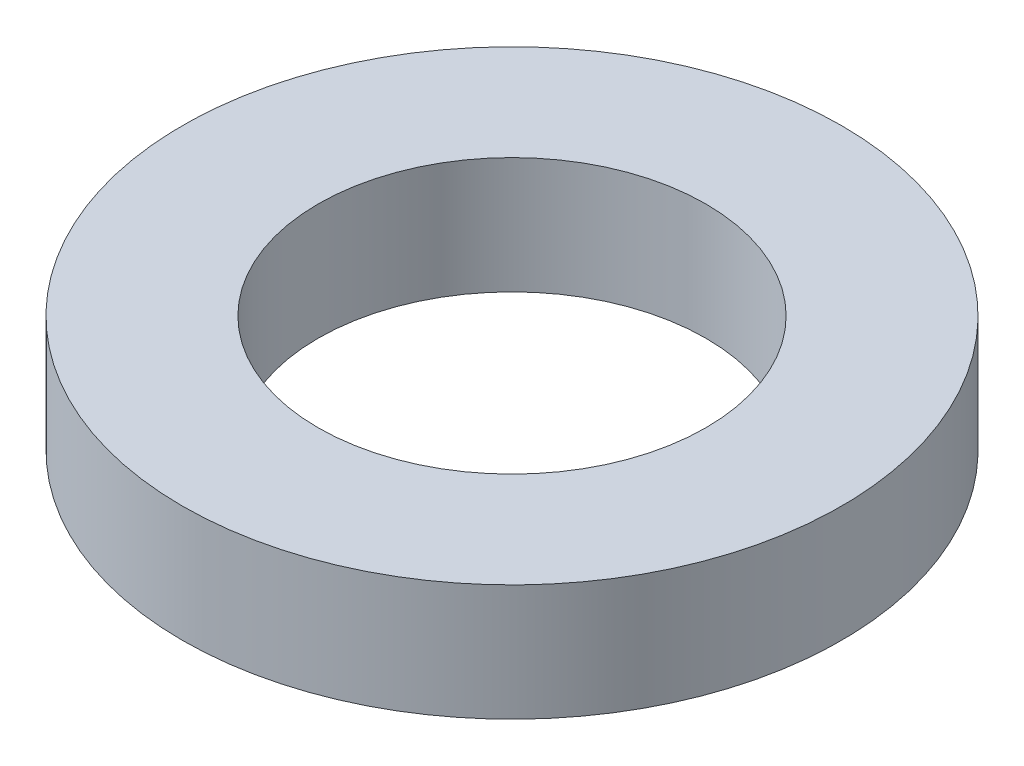
ISO-10303-21;
HEADER;
FILE_DESCRIPTION(('STEP AP214'),'2;1');
FILE_NAME('part.step','',(''),(''),'','','');
FILE_SCHEMA(('AUTOMOTIVE_DESIGN { 1 0 10303 214 1 1 1 1 }'));
ENDSEC;
DATA;
#1=APPLICATION_CONTEXT('core data for automotive mechanical design processes');
#2=APPLICATION_PROTOCOL_DEFINITION('international standard','automotive_design',2000,#1);
#3=PRODUCT_CONTEXT('',#1,'mechanical');
#4=PRODUCT('Part','Part','',(#3));
#5=PRODUCT_RELATED_PRODUCT_CATEGORY('part','',(#4));
#6=PRODUCT_DEFINITION_FORMATION('','',#4);
#7=PRODUCT_DEFINITION_CONTEXT('part definition',#1,'design');
#8=PRODUCT_DEFINITION('design','',#6,#7);
#9=PRODUCT_DEFINITION_SHAPE('','',#8);
#10=(LENGTH_UNIT() NAMED_UNIT(*) SI_UNIT(.MILLI.,.METRE.));
#11=(NAMED_UNIT(*) PLANE_ANGLE_UNIT() SI_UNIT($,.RADIAN.));
#12=(NAMED_UNIT(*) SI_UNIT($,.STERADIAN.) SOLID_ANGLE_UNIT());
#13=UNCERTAINTY_MEASURE_WITH_UNIT(LENGTH_MEASURE(1.E-05),#10,'distance_accuracy_value','');
#14=(GEOMETRIC_REPRESENTATION_CONTEXT(3) GLOBAL_UNCERTAINTY_ASSIGNED_CONTEXT((#13)) GLOBAL_UNIT_ASSIGNED_CONTEXT((#10,
#11,#12)) REPRESENTATION_CONTEXT('',''));
#15=CARTESIAN_POINT('',(0.,0.,0.));
#16=DIRECTION('',(0.,0.,1.));
#17=DIRECTION('',(1.,0.,0.));
#18=AXIS2_PLACEMENT_3D('',#15,#16,#17);
#19=CARTESIAN_POINT('',(0.,30.,0.));
#20=DIRECTION('',(0.,-1.,0.));
#21=DIRECTION('',(0.,0.,-1.));
#22=AXIS2_PLACEMENT_3D('',#19,#20,#21);
#23=CYLINDRICAL_SURFACE('',#22,85.);
#24=CARTESIAN_POINT('',(0.,30.,0.));
#25=DIRECTION('',(0.,1.,0.));
#26=DIRECTION('',(0.,0.,1.));
#27=AXIS2_PLACEMENT_3D('',#24,#25,#26);
#28=CIRCLE('',#27,85.);
#29=CARTESIAN_POINT('',(0.,30.,85.));
#30=VERTEX_POINT('',#29);
#31=EDGE_CURVE('E10',#30,#30,#28,.T.);
#32=ORIENTED_EDGE('',*,*,#31,.F.);
#33=EDGE_LOOP('',(#32));
#34=FACE_BOUND('',#33,.T.);
#35=CARTESIAN_POINT('',(0.,0.,0.));
#36=DIRECTION('',(0.,1.,0.));
#37=DIRECTION('',(0.,0.,1.));
#38=AXIS2_PLACEMENT_3D('',#35,#36,#37);
#39=CIRCLE('',#38,85.);
#40=CARTESIAN_POINT('',(0.,0.,85.));
#41=VERTEX_POINT('',#40);
#42=EDGE_CURVE('E37',#41,#41,#39,.T.);
#43=ORIENTED_EDGE('',*,*,#42,.T.);
#44=EDGE_LOOP('',(#43));
#45=FACE_BOUND('',#44,.T.);
#46=ADVANCED_FACE('F40',(#34,#45),#23,.T.);
#47=CARTESIAN_POINT('',(0.,30.,0.));
#48=DIRECTION('',(0.,1.,0.));
#49=DIRECTION('',(0.,0.,1.));
#50=AXIS2_PLACEMENT_3D('',#47,#48,#49);
#51=PLANE('',#50);
#52=CARTESIAN_POINT('',(0.,30.,0.));
#53=DIRECTION('',(0.,1.,0.));
#54=DIRECTION('',(0.,0.,1.));
#55=AXIS2_PLACEMENT_3D('',#52,#53,#54);
#56=CIRCLE('',#55,50.);
#57=CARTESIAN_POINT('',(0.,30.,50.));
#58=VERTEX_POINT('',#57);
#59=EDGE_CURVE('E50',#58,#58,#56,.T.);
#60=ORIENTED_EDGE('',*,*,#59,.F.);
#61=EDGE_LOOP('',(#60));
#62=FACE_BOUND('',#61,.T.);
#63=ORIENTED_EDGE('',*,*,#31,.T.);
#64=EDGE_LOOP('',(#63));
#65=FACE_BOUND('',#64,.T.);
#66=ADVANCED_FACE('F59',(#62,#65),#51,.T.);
#67=CARTESIAN_POINT('',(0.,0.,0.));
#68=DIRECTION('',(0.,1.,0.));
#69=DIRECTION('',(0.,0.,1.));
#70=AXIS2_PLACEMENT_3D('',#67,#68,#69);
#71=PLANE('',#70);
#72=CARTESIAN_POINT('',(0.,0.,0.));
#73=DIRECTION('',(0.,1.,0.));
#74=DIRECTION('',(0.,0.,1.));
#75=AXIS2_PLACEMENT_3D('',#72,#73,#74);
#76=CIRCLE('',#75,50.);
#77=CARTESIAN_POINT('',(0.,0.,50.));
#78=VERTEX_POINT('',#77);
#79=EDGE_CURVE('E47',#78,#78,#76,.T.);
#80=ORIENTED_EDGE('',*,*,#79,.T.);
#81=EDGE_LOOP('',(#80));
#82=FACE_BOUND('',#81,.T.);
#83=ORIENTED_EDGE('',*,*,#42,.F.);
#84=EDGE_LOOP('',(#83));
#85=FACE_BOUND('',#84,.T.);
#86=ADVANCED_FACE('F58',(#82,#85),#71,.F.);
#87=CARTESIAN_POINT('',(0.,30.,0.));
#88=DIRECTION('',(0.,-1.,0.));
#89=DIRECTION('',(0.,0.,-1.));
#90=AXIS2_PLACEMENT_3D('',#87,#88,#89);
#91=CYLINDRICAL_SURFACE('',#90,50.);
#92=ORIENTED_EDGE('',*,*,#59,.T.);
#93=EDGE_LOOP('',(#92));
#94=FACE_BOUND('',#93,.T.);
#95=ORIENTED_EDGE('',*,*,#79,.F.);
#96=EDGE_LOOP('',(#95));
#97=FACE_BOUND('',#96,.T.);
#98=ADVANCED_FACE('F54',(#94,#97),#91,.F.);
#99=CLOSED_SHELL('',(#46,#66,#86,#98));
#100=MANIFOLD_SOLID_BREP('B2',#99);
#101=ADVANCED_BREP_SHAPE_REPRESENTATION('',(#18,#100),#14);
#102=SHAPE_DEFINITION_REPRESENTATION(#9,#101);
ENDSEC;
END-ISO-10303-21;
